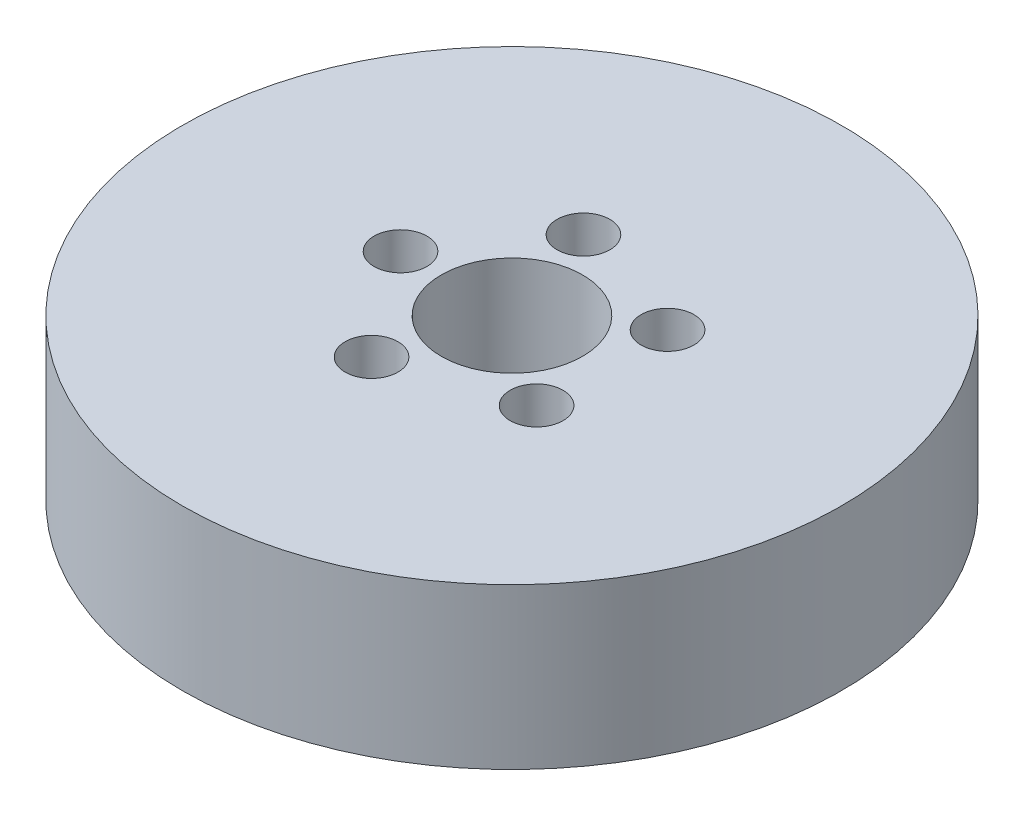
ISO-10303-21;
HEADER;
FILE_DESCRIPTION(('STEP AP214'),'2;1');
FILE_NAME('part.step','',(''),(''),'','','');
FILE_SCHEMA(('AUTOMOTIVE_DESIGN { 1 0 10303 214 1 1 1 1 }'));
ENDSEC;
DATA;
#1=APPLICATION_CONTEXT('core data for automotive mechanical design processes');
#2=APPLICATION_PROTOCOL_DEFINITION('international standard','automotive_design',2000,#1);
#3=PRODUCT_CONTEXT('',#1,'mechanical');
#4=PRODUCT('Part','Part','',(#3));
#5=PRODUCT_RELATED_PRODUCT_CATEGORY('part','',(#4));
#6=PRODUCT_DEFINITION_FORMATION('','',#4);
#7=PRODUCT_DEFINITION_CONTEXT('part definition',#1,'design');
#8=PRODUCT_DEFINITION('design','',#6,#7);
#9=PRODUCT_DEFINITION_SHAPE('','',#8);
#10=(LENGTH_UNIT() NAMED_UNIT(*) SI_UNIT(.MILLI.,.METRE.));
#11=(NAMED_UNIT(*) PLANE_ANGLE_UNIT() SI_UNIT($,.RADIAN.));
#12=(NAMED_UNIT(*) SI_UNIT($,.STERADIAN.) SOLID_ANGLE_UNIT());
#13=UNCERTAINTY_MEASURE_WITH_UNIT(LENGTH_MEASURE(1.E-05),#10,'distance_accuracy_value','');
#14=(GEOMETRIC_REPRESENTATION_CONTEXT(3) GLOBAL_UNCERTAINTY_ASSIGNED_CONTEXT((#13)) GLOBAL_UNIT_ASSIGNED_CONTEXT((#10,
#11,#12)) REPRESENTATION_CONTEXT('',''));
#15=CARTESIAN_POINT('',(0.,0.,0.));
#16=DIRECTION('',(0.,0.,1.));
#17=DIRECTION('',(1.,0.,0.));
#18=AXIS2_PLACEMENT_3D('',#15,#16,#17);
#19=CARTESIAN_POINT('',(0.,17.,0.));
#20=DIRECTION('',(0.,-1.,0.));
#21=DIRECTION('',(0.,0.,-1.));
#22=AXIS2_PLACEMENT_3D('',#19,#20,#21);
#23=CYLINDRICAL_SURFACE('',#22,35.);
#24=CARTESIAN_POINT('',(0.,17.,0.));
#25=DIRECTION('',(0.,1.,0.));
#26=DIRECTION('',(0.,0.,1.));
#27=AXIS2_PLACEMENT_3D('',#24,#25,#26);
#28=CIRCLE('',#27,35.);
#29=CARTESIAN_POINT('',(0.,17.,35.));
#30=VERTEX_POINT('',#29);
#31=EDGE_CURVE('E10',#30,#30,#28,.T.);
#32=ORIENTED_EDGE('',*,*,#31,.F.);
#33=EDGE_LOOP('',(#32));
#34=FACE_BOUND('',#33,.T.);
#35=CARTESIAN_POINT('',(0.,0.,0.));
#36=DIRECTION('',(0.,1.,0.));
#37=DIRECTION('',(0.,0.,1.));
#38=AXIS2_PLACEMENT_3D('',#35,#36,#37);
#39=CIRCLE('',#38,35.);
#40=CARTESIAN_POINT('',(0.,0.,35.));
#41=VERTEX_POINT('',#40);
#42=EDGE_CURVE('E37',#41,#41,#39,.T.);
#43=ORIENTED_EDGE('',*,*,#42,.T.);
#44=EDGE_LOOP('',(#43));
#45=FACE_BOUND('',#44,.T.);
#46=ADVANCED_FACE('F40',(#34,#45),#23,.T.);
#47=CARTESIAN_POINT('',(0.,17.,0.));
#48=DIRECTION('',(0.,1.,0.));
#49=DIRECTION('',(0.,0.,1.));
#50=AXIS2_PLACEMENT_3D('',#47,#48,#49);
#51=PLANE('',#50);
#52=CARTESIAN_POINT('',(-3.65574556112441,17.,-11.2512279295737));
#53=DIRECTION('',(0.,1.,0.));
#54=DIRECTION('',(-0.95105651629515,0.,0.309016994374958));
#55=AXIS2_PLACEMENT_3D('',#52,#53,#54);
#56=CIRCLE('',#55,2.80533204484746);
#57=CARTESIAN_POINT('',(-6.32377488274819,17.,-10.3843326528512));
#58=VERTEX_POINT('',#57);
#59=EDGE_CURVE('E70',#58,#58,#56,.T.);
#60=ORIENTED_EDGE('',*,*,#59,.F.);
#61=EDGE_LOOP('',(#60));
#62=FACE_BOUND('',#61,.T.);
#63=CARTESIAN_POINT('',(9.57086613324488,17.,-6.95364127564876));
#64=DIRECTION('',(0.,1.,0.));
#65=DIRECTION('',(-0.58778525229248,0.,-0.809016994374942));
#66=AXIS2_PLACEMENT_3D('',#63,#64,#65);
#67=CIRCLE('',#66,2.80533204484746);
#68=CARTESIAN_POINT('',(7.92193332950004,17.,-9.22320257479496));
#69=VERTEX_POINT('',#68);
#70=EDGE_CURVE('E71',#69,#69,#67,.T.);
#71=ORIENTED_EDGE('',*,*,#70,.F.);
#72=EDGE_LOOP('',(#71));
#73=FACE_BOUND('',#72,.T.);
#74=CARTESIAN_POINT('',(9.57086613324498,17.,6.95364127564862));
#75=DIRECTION('',(0.,1.,0.));
#76=DIRECTION('',(0.587785252292469,0.,-0.809016994374951));
#77=AXIS2_PLACEMENT_3D('',#74,#75,#76);
#78=CIRCLE('',#77,2.80533204484746);
#79=CARTESIAN_POINT('',(11.2197989369898,17.,4.68407997650239));
#80=VERTEX_POINT('',#79);
#81=EDGE_CURVE('E78',#80,#80,#78,.T.);
#82=ORIENTED_EDGE('',*,*,#81,.F.);
#83=EDGE_LOOP('',(#82));
#84=FACE_BOUND('',#83,.T.);
#85=CARTESIAN_POINT('',(-3.65574556112426,17.,11.2512279295737));
#86=DIRECTION('',(0.,1.,0.));
#87=DIRECTION('',(0.951056516295155,0.,0.309016994374945));
#88=AXIS2_PLACEMENT_3D('',#85,#86,#87);
#89=CIRCLE('',#88,2.80533204484746);
#90=CARTESIAN_POINT('',(-0.987716239500469,17.,12.1181232062962));
#91=VERTEX_POINT('',#90);
#92=EDGE_CURVE('E61',#91,#91,#89,.T.);
#93=ORIENTED_EDGE('',*,*,#92,.F.);
#94=EDGE_LOOP('',(#93));
#95=FACE_BOUND('',#94,.T.);
#96=CARTESIAN_POINT('',(-11.8302411442413,17.,0.));
#97=DIRECTION('',(0.,1.,0.));
#98=DIRECTION('',(0.,0.,1.));
#99=AXIS2_PLACEMENT_3D('',#96,#97,#98);
#100=CIRCLE('',#99,2.80533204484746);
#101=CARTESIAN_POINT('',(-11.8302411442413,17.,2.80533204484746));
#102=VERTEX_POINT('',#101);
#103=EDGE_CURVE('E54',#102,#102,#100,.T.);
#104=ORIENTED_EDGE('',*,*,#103,.F.);
#105=EDGE_LOOP('',(#104));
#106=FACE_BOUND('',#105,.T.);
#107=CARTESIAN_POINT('',(0.,17.,0.));
#108=DIRECTION('',(0.,1.,0.));
#109=DIRECTION('',(0.,0.,1.));
#110=AXIS2_PLACEMENT_3D('',#107,#108,#109);
#111=CIRCLE('',#110,7.5);
#112=CARTESIAN_POINT('',(0.,17.,7.5));
#113=VERTEX_POINT('',#112);
#114=EDGE_CURVE('E50',#113,#113,#111,.T.);
#115=ORIENTED_EDGE('',*,*,#114,.F.);
#116=EDGE_LOOP('',(#115));
#117=FACE_BOUND('',#116,.T.);
#118=ORIENTED_EDGE('',*,*,#31,.T.);
#119=EDGE_LOOP('',(#118));
#120=FACE_BOUND('',#119,.T.);
#121=ADVANCED_FACE('F94',(#62,#73,#84,#95,#106,#117,#120),#51,.T.);
#122=CARTESIAN_POINT('',(0.,0.,0.));
#123=DIRECTION('',(0.,1.,0.));
#124=DIRECTION('',(0.,0.,1.));
#125=AXIS2_PLACEMENT_3D('',#122,#123,#124);
#126=PLANE('',#125);
#127=CARTESIAN_POINT('',(0.,0.,0.));
#128=DIRECTION('',(0.,1.,0.));
#129=DIRECTION('',(0.,0.,1.));
#130=AXIS2_PLACEMENT_3D('',#127,#128,#129);
#131=CIRCLE('',#130,7.5);
#132=CARTESIAN_POINT('',(0.,0.,7.5));
#133=VERTEX_POINT('',#132);
#134=EDGE_CURVE('E47',#133,#133,#131,.T.);
#135=ORIENTED_EDGE('',*,*,#134,.T.);
#136=EDGE_LOOP('',(#135));
#137=FACE_BOUND('',#136,.T.);
#138=ORIENTED_EDGE('',*,*,#42,.F.);
#139=EDGE_LOOP('',(#138));
#140=FACE_BOUND('',#139,.T.);
#141=ADVANCED_FACE('F100',(#137,#140),#126,.F.);
#142=CARTESIAN_POINT('',(0.,17.,0.));
#143=DIRECTION('',(0.,-1.,0.));
#144=DIRECTION('',(0.,0.,-1.));
#145=AXIS2_PLACEMENT_3D('',#142,#143,#144);
#146=CYLINDRICAL_SURFACE('',#145,7.5);
#147=ORIENTED_EDGE('',*,*,#114,.T.);
#148=EDGE_LOOP('',(#147));
#149=FACE_BOUND('',#148,.T.);
#150=ORIENTED_EDGE('',*,*,#134,.F.);
#151=EDGE_LOOP('',(#150));
#152=FACE_BOUND('',#151,.T.);
#153=ADVANCED_FACE('F106',(#149,#152),#146,.F.);
#154=CARTESIAN_POINT('',(-11.8302411442413,0.33601831469959,0.));
#155=DIRECTION('',(0.,1.,0.));
#156=DIRECTION('',(0.,0.,1.));
#157=AXIS2_PLACEMENT_3D('',#154,#155,#156);
#158=CYLINDRICAL_SURFACE('',#157,2.80533204484746);
#159=CARTESIAN_POINT('',(-11.8302411442413,0.33601831469959,0.));
#160=DIRECTION('',(0.,1.,0.));
#161=DIRECTION('',(0.,0.,1.));
#162=AXIS2_PLACEMENT_3D('',#159,#160,#161);
#163=CIRCLE('',#162,2.80533204484746);
#164=CARTESIAN_POINT('',(-11.8302411442413,0.33601831469959,2.80533204484746));
#165=VERTEX_POINT('',#164);
#166=EDGE_CURVE('E55',#165,#165,#163,.T.);
#167=ORIENTED_EDGE('',*,*,#166,.F.);
#168=EDGE_LOOP('',(#167));
#169=FACE_BOUND('',#168,.T.);
#170=ORIENTED_EDGE('',*,*,#103,.T.);
#171=EDGE_LOOP('',(#170));
#172=FACE_BOUND('',#171,.T.);
#173=ADVANCED_FACE('F108',(#169,#172),#158,.F.);
#174=CARTESIAN_POINT('',(-11.8302411442413,0.33601831469959,0.));
#175=DIRECTION('',(0.,1.,0.));
#176=DIRECTION('',(0.,0.,1.));
#177=AXIS2_PLACEMENT_3D('',#174,#175,#176);
#178=PLANE('',#177);
#179=ORIENTED_EDGE('',*,*,#166,.T.);
#180=EDGE_LOOP('',(#179));
#181=FACE_BOUND('',#180,.T.);
#182=ADVANCED_FACE('F138',(#181),#178,.T.);
#183=CARTESIAN_POINT('',(-3.65574556112426,0.33601831469959,11.2512279295737));
#184=DIRECTION('',(0.,1.,0.));
#185=DIRECTION('',(0.,0.,1.));
#186=AXIS2_PLACEMENT_3D('',#183,#184,#185);
#187=CYLINDRICAL_SURFACE('',#186,2.80533204484746);
#188=CARTESIAN_POINT('',(-3.65574556112426,0.33601831469959,11.2512279295737));
#189=DIRECTION('',(0.,1.,0.));
#190=DIRECTION('',(0.951056516295155,0.,0.309016994374945));
#191=AXIS2_PLACEMENT_3D('',#188,#189,#190);
#192=CIRCLE('',#191,2.80533204484746);
#193=CARTESIAN_POINT('',(-0.987716239500469,0.33601831469959,12.1181232062962));
#194=VERTEX_POINT('',#193);
#195=EDGE_CURVE('E59',#194,#194,#192,.T.);
#196=ORIENTED_EDGE('',*,*,#195,.F.);
#197=EDGE_LOOP('',(#196));
#198=FACE_BOUND('',#197,.T.);
#199=ORIENTED_EDGE('',*,*,#92,.T.);
#200=EDGE_LOOP('',(#199));
#201=FACE_BOUND('',#200,.T.);
#202=ADVANCED_FACE('F150',(#198,#201),#187,.F.);
#203=CARTESIAN_POINT('',(-3.65574556112426,0.33601831469959,11.2512279295737));
#204=DIRECTION('',(0.,1.,0.));
#205=DIRECTION('',(0.951056516295155,0.,0.309016994374945));
#206=AXIS2_PLACEMENT_3D('',#203,#204,#205);
#207=PLANE('',#206);
#208=ORIENTED_EDGE('',*,*,#195,.T.);
#209=EDGE_LOOP('',(#208));
#210=FACE_BOUND('',#209,.T.);
#211=ADVANCED_FACE('F89',(#210),#207,.T.);
#212=CARTESIAN_POINT('',(9.57086613324498,0.33601831469959,6.95364127564862));
#213=DIRECTION('',(0.,1.,0.));
#214=DIRECTION('',(0.,0.,1.));
#215=AXIS2_PLACEMENT_3D('',#212,#213,#214);
#216=CYLINDRICAL_SURFACE('',#215,2.80533204484746);
#217=CARTESIAN_POINT('',(9.57086613324498,0.33601831469959,6.95364127564862));
#218=DIRECTION('',(0.,1.,0.));
#219=DIRECTION('',(0.587785252292469,0.,-0.809016994374951));
#220=AXIS2_PLACEMENT_3D('',#217,#218,#219);
#221=CIRCLE('',#220,2.80533204484746);
#222=CARTESIAN_POINT('',(11.2197989369898,0.33601831469959,4.68407997650239));
#223=VERTEX_POINT('',#222);
#224=EDGE_CURVE('E63',#223,#223,#221,.T.);
#225=ORIENTED_EDGE('',*,*,#224,.F.);
#226=EDGE_LOOP('',(#225));
#227=FACE_BOUND('',#226,.T.);
#228=ORIENTED_EDGE('',*,*,#81,.T.);
#229=EDGE_LOOP('',(#228));
#230=FACE_BOUND('',#229,.T.);
#231=ADVANCED_FACE('F87',(#227,#230),#216,.F.);
#232=CARTESIAN_POINT('',(9.57086613324498,0.33601831469959,6.95364127564862));
#233=DIRECTION('',(0.,1.,0.));
#234=DIRECTION('',(0.587785252292469,0.,-0.809016994374951));
#235=AXIS2_PLACEMENT_3D('',#232,#233,#234);
#236=PLANE('',#235);
#237=ORIENTED_EDGE('',*,*,#224,.T.);
#238=EDGE_LOOP('',(#237));
#239=FACE_BOUND('',#238,.T.);
#240=ADVANCED_FACE('F84',(#239),#236,.T.);
#241=CARTESIAN_POINT('',(9.57086613324488,0.33601831469959,-6.95364127564876));
#242=DIRECTION('',(0.,1.,0.));
#243=DIRECTION('',(0.,0.,1.));
#244=AXIS2_PLACEMENT_3D('',#241,#242,#243);
#245=CYLINDRICAL_SURFACE('',#244,2.80533204484746);
#246=CARTESIAN_POINT('',(9.57086613324488,0.33601831469959,-6.95364127564876));
#247=DIRECTION('',(0.,1.,0.));
#248=DIRECTION('',(-0.58778525229248,0.,-0.809016994374942));
#249=AXIS2_PLACEMENT_3D('',#246,#247,#248);
#250=CIRCLE('',#249,2.80533204484746);
#251=CARTESIAN_POINT('',(7.92193332950004,0.33601831469959,-9.22320257479496));
#252=VERTEX_POINT('',#251);
#253=EDGE_CURVE('E76',#252,#252,#250,.T.);
#254=ORIENTED_EDGE('',*,*,#253,.F.);
#255=EDGE_LOOP('',(#254));
#256=FACE_BOUND('',#255,.T.);
#257=ORIENTED_EDGE('',*,*,#70,.T.);
#258=EDGE_LOOP('',(#257));
#259=FACE_BOUND('',#258,.T.);
#260=ADVANCED_FACE('F185',(#256,#259),#245,.F.);
#261=CARTESIAN_POINT('',(9.57086613324488,0.33601831469959,-6.95364127564876));
#262=DIRECTION('',(0.,1.,0.));
#263=DIRECTION('',(-0.58778525229248,0.,-0.809016994374942));
#264=AXIS2_PLACEMENT_3D('',#261,#262,#263);
#265=PLANE('',#264);
#266=ORIENTED_EDGE('',*,*,#253,.T.);
#267=EDGE_LOOP('',(#266));
#268=FACE_BOUND('',#267,.T.);
#269=ADVANCED_FACE('F189',(#268),#265,.T.);
#270=CARTESIAN_POINT('',(-3.65574556112441,0.33601831469959,-11.2512279295737));
#271=DIRECTION('',(0.,1.,0.));
#272=DIRECTION('',(0.,0.,1.));
#273=AXIS2_PLACEMENT_3D('',#270,#271,#272);
#274=CYLINDRICAL_SURFACE('',#273,2.80533204484746);
#275=CARTESIAN_POINT('',(-3.65574556112441,0.33601831469959,-11.2512279295737));
#276=DIRECTION('',(0.,1.,0.));
#277=DIRECTION('',(-0.95105651629515,0.,0.309016994374958));
#278=AXIS2_PLACEMENT_3D('',#275,#276,#277);
#279=CIRCLE('',#278,2.80533204484746);
#280=CARTESIAN_POINT('',(-6.32377488274819,0.33601831469959,-10.3843326528512));
#281=VERTEX_POINT('',#280);
#282=EDGE_CURVE('E69',#281,#281,#279,.T.);
#283=ORIENTED_EDGE('',*,*,#282,.F.);
#284=EDGE_LOOP('',(#283));
#285=FACE_BOUND('',#284,.T.);
#286=ORIENTED_EDGE('',*,*,#59,.T.);
#287=EDGE_LOOP('',(#286));
#288=FACE_BOUND('',#287,.T.);
#289=ADVANCED_FACE('F200',(#285,#288),#274,.F.);
#290=CARTESIAN_POINT('',(-3.65574556112441,0.33601831469959,-11.2512279295737));
#291=DIRECTION('',(0.,1.,0.));
#292=DIRECTION('',(-0.95105651629515,0.,0.309016994374958));
#293=AXIS2_PLACEMENT_3D('',#290,#291,#292);
#294=PLANE('',#293);
#295=ORIENTED_EDGE('',*,*,#282,.T.);
#296=EDGE_LOOP('',(#295));
#297=FACE_BOUND('',#296,.T.);
#298=ADVANCED_FACE('F208',(#297),#294,.T.);
#299=CLOSED_SHELL('',(#46,#121,#141,#153,#173,#182,#202,#211,#231,#240,#260,#269,#289,#298));
#300=MANIFOLD_SOLID_BREP('B2',#299);
#301=ADVANCED_BREP_SHAPE_REPRESENTATION('',(#18,#300),#14);
#302=SHAPE_DEFINITION_REPRESENTATION(#9,#301);
ENDSEC;
END-ISO-10303-21;
